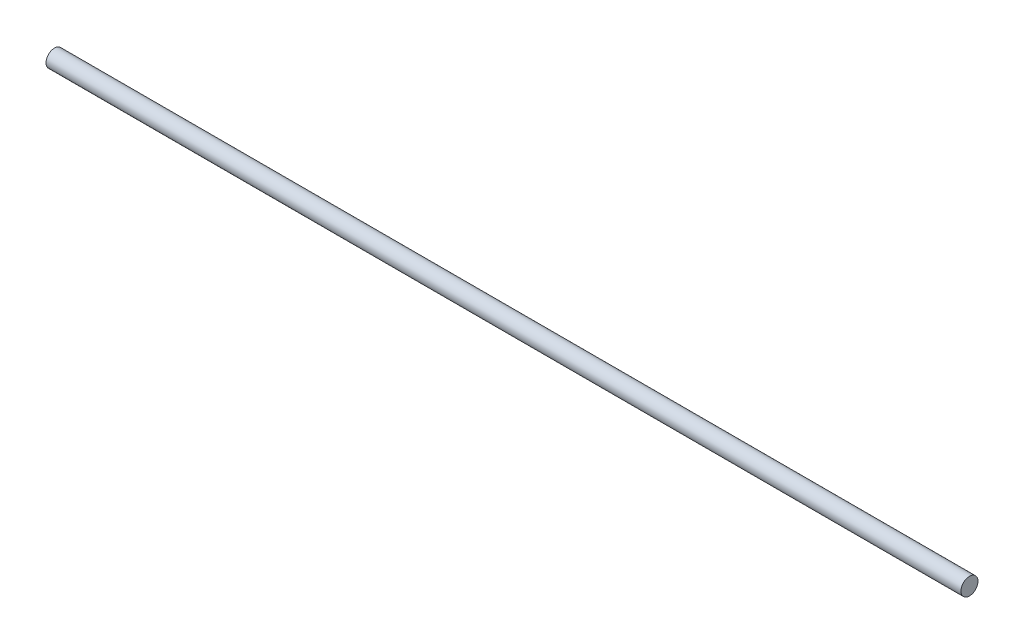
ISO-10303-21;
HEADER;
FILE_DESCRIPTION(('STEP AP214'),'2;1');
FILE_NAME('part.step','',(''),(''),'','','');
FILE_SCHEMA(('AUTOMOTIVE_DESIGN { 1 0 10303 214 1 1 1 1 }'));
ENDSEC;
DATA;
#1=APPLICATION_CONTEXT('core data for automotive mechanical design processes');
#2=APPLICATION_PROTOCOL_DEFINITION('international standard','automotive_design',2000,#1);
#3=PRODUCT_CONTEXT('',#1,'mechanical');
#4=PRODUCT('Part','Part','',(#3));
#5=PRODUCT_RELATED_PRODUCT_CATEGORY('part','',(#4));
#6=PRODUCT_DEFINITION_FORMATION('','',#4);
#7=PRODUCT_DEFINITION_CONTEXT('part definition',#1,'design');
#8=PRODUCT_DEFINITION('design','',#6,#7);
#9=PRODUCT_DEFINITION_SHAPE('','',#8);
#10=(LENGTH_UNIT() NAMED_UNIT(*) SI_UNIT(.MILLI.,.METRE.));
#11=(NAMED_UNIT(*) PLANE_ANGLE_UNIT() SI_UNIT($,.RADIAN.));
#12=(NAMED_UNIT(*) SI_UNIT($,.STERADIAN.) SOLID_ANGLE_UNIT());
#13=UNCERTAINTY_MEASURE_WITH_UNIT(LENGTH_MEASURE(1.E-05),#10,'distance_accuracy_value','');
#14=(GEOMETRIC_REPRESENTATION_CONTEXT(3) GLOBAL_UNCERTAINTY_ASSIGNED_CONTEXT((#13)) GLOBAL_UNIT_ASSIGNED_CONTEXT((#10,
#11,#12)) REPRESENTATION_CONTEXT('',''));
#15=CARTESIAN_POINT('',(0.,0.,0.));
#16=DIRECTION('',(0.,0.,1.));
#17=DIRECTION('',(1.,0.,0.));
#18=AXIS2_PLACEMENT_3D('',#15,#16,#17);
#19=CARTESIAN_POINT('',(161.,0.,0.));
#20=DIRECTION('',(1.,0.,0.));
#21=DIRECTION('',(0.,0.,-1.));
#22=AXIS2_PLACEMENT_3D('',#19,#20,#21);
#23=PLANE('',#22);
#24=CARTESIAN_POINT('',(161.,0.,0.));
#25=DIRECTION('',(1.,0.,0.));
#26=DIRECTION('',(0.,0.,-1.));
#27=AXIS2_PLACEMENT_3D('',#24,#25,#26);
#28=CIRCLE('',#27,3.);
#29=CARTESIAN_POINT('',(161.,0.,-3.));
#30=VERTEX_POINT('',#29);
#31=EDGE_CURVE('E10',#30,#30,#28,.T.);
#32=ORIENTED_EDGE('',*,*,#31,.T.);
#33=EDGE_LOOP('',(#32));
#34=FACE_BOUND('',#33,.T.);
#35=CARTESIAN_POINT('',(161.,0.,0.));
#36=DIRECTION('',(1.,0.,0.));
#37=DIRECTION('',(0.,0.,-1.));
#38=AXIS2_PLACEMENT_3D('',#35,#36,#37);
#39=CIRCLE('',#38,0.00299999999999996);
#40=CARTESIAN_POINT('',(161.,0.,-0.00299999999999996));
#41=VERTEX_POINT('',#40);
#42=EDGE_CURVE('E42',#41,#41,#39,.T.);
#43=ORIENTED_EDGE('',*,*,#42,.F.);
#44=EDGE_LOOP('',(#43));
#45=FACE_BOUND('',#44,.T.);
#46=ADVANCED_FACE('F31',(#34,#45),#23,.T.);
#47=CARTESIAN_POINT('',(-161.,0.,0.));
#48=DIRECTION('',(1.,0.,0.));
#49=DIRECTION('',(0.,0.,-1.));
#50=AXIS2_PLACEMENT_3D('',#47,#48,#49);
#51=PLANE('',#50);
#52=CARTESIAN_POINT('',(-161.,0.,0.));
#53=DIRECTION('',(1.,0.,0.));
#54=DIRECTION('',(0.,0.,-1.));
#55=AXIS2_PLACEMENT_3D('',#52,#53,#54);
#56=CIRCLE('',#55,3.);
#57=CARTESIAN_POINT('',(-161.,0.,-3.));
#58=VERTEX_POINT('',#57);
#59=EDGE_CURVE('E35',#58,#58,#56,.T.);
#60=ORIENTED_EDGE('',*,*,#59,.F.);
#61=EDGE_LOOP('',(#60));
#62=FACE_BOUND('',#61,.T.);
#63=CARTESIAN_POINT('',(-161.,0.,0.));
#64=DIRECTION('',(1.,0.,0.));
#65=DIRECTION('',(0.,0.,-1.));
#66=AXIS2_PLACEMENT_3D('',#63,#64,#65);
#67=CIRCLE('',#66,0.00299999999999996);
#68=CARTESIAN_POINT('',(-161.,0.,-0.00299999999999996));
#69=VERTEX_POINT('',#68);
#70=EDGE_CURVE('E44',#69,#69,#67,.T.);
#71=ORIENTED_EDGE('',*,*,#70,.T.);
#72=EDGE_LOOP('',(#71));
#73=FACE_BOUND('',#72,.T.);
#74=ADVANCED_FACE('F54',(#62,#73),#51,.F.);
#75=CARTESIAN_POINT('',(161.,0.,0.));
#76=DIRECTION('',(-1.,0.,0.));
#77=DIRECTION('',(0.,0.,1.));
#78=AXIS2_PLACEMENT_3D('',#75,#76,#77);
#79=CYLINDRICAL_SURFACE('',#78,3.);
#80=ORIENTED_EDGE('',*,*,#31,.F.);
#81=EDGE_LOOP('',(#80));
#82=FACE_BOUND('',#81,.T.);
#83=ORIENTED_EDGE('',*,*,#59,.T.);
#84=EDGE_LOOP('',(#83));
#85=FACE_BOUND('',#84,.T.);
#86=ADVANCED_FACE('F33',(#82,#85),#79,.T.);
#87=CARTESIAN_POINT('',(161.,0.,0.));
#88=DIRECTION('',(-1.,0.,0.));
#89=DIRECTION('',(0.,0.,1.));
#90=AXIS2_PLACEMENT_3D('',#87,#88,#89);
#91=CYLINDRICAL_SURFACE('',#90,0.00299999999999996);
#92=ORIENTED_EDGE('',*,*,#42,.T.);
#93=EDGE_LOOP('',(#92));
#94=FACE_BOUND('',#93,.T.);
#95=ORIENTED_EDGE('',*,*,#70,.F.);
#96=EDGE_LOOP('',(#95));
#97=FACE_BOUND('',#96,.T.);
#98=ADVANCED_FACE('F50',(#94,#97),#91,.F.);
#99=CLOSED_SHELL('',(#46,#74,#86,#98));
#100=MANIFOLD_SOLID_BREP('B2',#99);
#101=ADVANCED_BREP_SHAPE_REPRESENTATION('',(#18,#100),#14);
#102=SHAPE_DEFINITION_REPRESENTATION(#9,#101);
ENDSEC;
END-ISO-10303-21;
